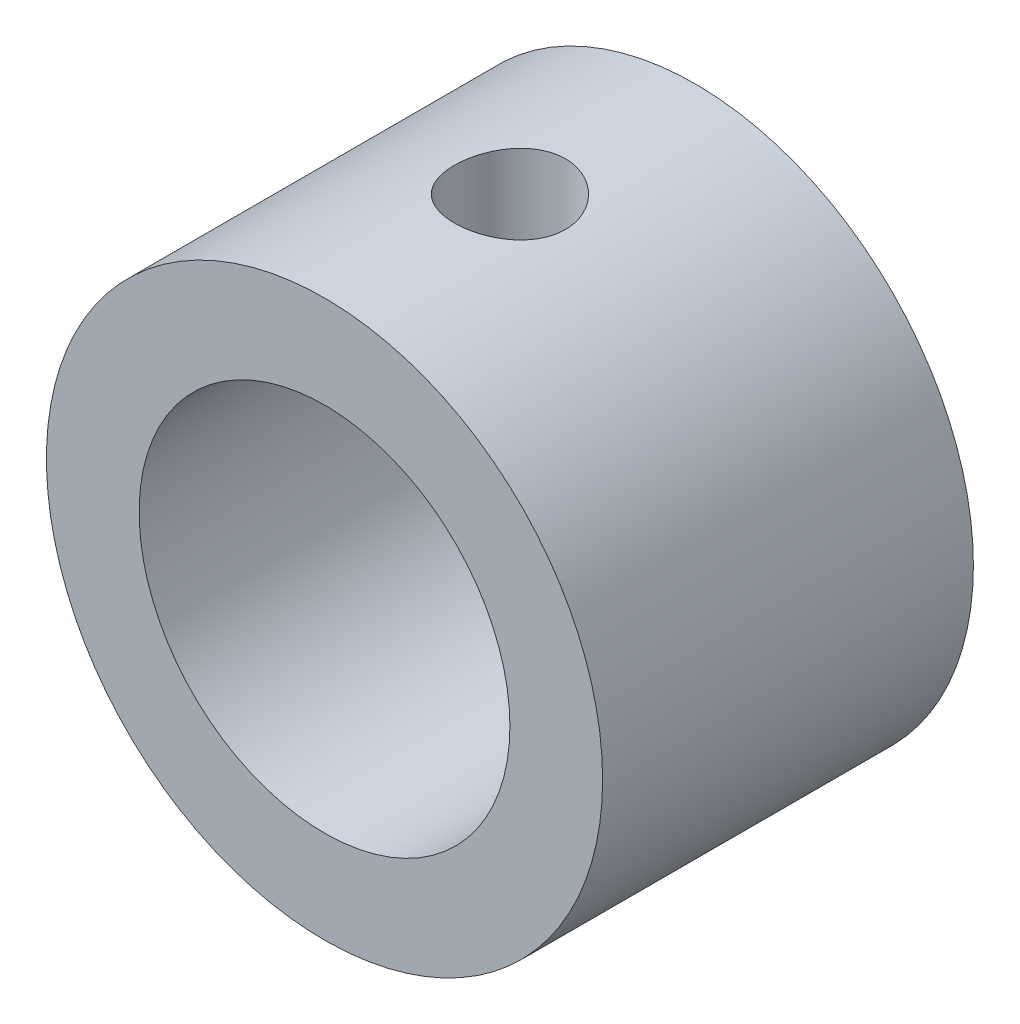
ISO-10303-21;
HEADER;
FILE_DESCRIPTION(('STEP AP214'),'2;1');
FILE_NAME('part.step','',(''),(''),'','','');
FILE_SCHEMA(('AUTOMOTIVE_DESIGN { 1 0 10303 214 1 1 1 1 }'));
ENDSEC;
DATA;
#1=APPLICATION_CONTEXT('core data for automotive mechanical design processes');
#2=APPLICATION_PROTOCOL_DEFINITION('international standard','automotive_design',2000,#1);
#3=PRODUCT_CONTEXT('',#1,'mechanical');
#4=PRODUCT('Part','Part','',(#3));
#5=PRODUCT_RELATED_PRODUCT_CATEGORY('part','',(#4));
#6=PRODUCT_DEFINITION_FORMATION('','',#4);
#7=PRODUCT_DEFINITION_CONTEXT('part definition',#1,'design');
#8=PRODUCT_DEFINITION('design','',#6,#7);
#9=PRODUCT_DEFINITION_SHAPE('','',#8);
#10=(LENGTH_UNIT() NAMED_UNIT(*) SI_UNIT(.MILLI.,.METRE.));
#11=(NAMED_UNIT(*) PLANE_ANGLE_UNIT() SI_UNIT($,.RADIAN.));
#12=(NAMED_UNIT(*) SI_UNIT($,.STERADIAN.) SOLID_ANGLE_UNIT());
#13=UNCERTAINTY_MEASURE_WITH_UNIT(LENGTH_MEASURE(1.E-05),#10,'distance_accuracy_value','');
#14=(GEOMETRIC_REPRESENTATION_CONTEXT(3) GLOBAL_UNCERTAINTY_ASSIGNED_CONTEXT((#13)) GLOBAL_UNIT_ASSIGNED_CONTEXT((#10,
#11,#12)) REPRESENTATION_CONTEXT('',''));
#15=CARTESIAN_POINT('',(0.,0.,0.));
#16=DIRECTION('',(0.,0.,1.));
#17=DIRECTION('',(1.,0.,0.));
#18=AXIS2_PLACEMENT_3D('',#15,#16,#17);
#19=CARTESIAN_POINT('',(0.,0.,5.));
#20=DIRECTION('',(0.,0.,-1.));
#21=DIRECTION('',(-1.,0.,0.));
#22=AXIS2_PLACEMENT_3D('',#19,#20,#21);
#23=CYLINDRICAL_SURFACE('',#22,7.5);
#24=CARTESIAN_POINT('',(0.,0.,5.));
#25=DIRECTION('',(0.,0.,1.));
#26=DIRECTION('',(1.,0.,0.));
#27=AXIS2_PLACEMENT_3D('',#24,#25,#26);
#28=CIRCLE('',#27,7.5);
#29=CARTESIAN_POINT('',(7.5,0.,5.));
#30=VERTEX_POINT('',#29);
#31=EDGE_CURVE('E10',#30,#30,#28,.T.);
#32=ORIENTED_EDGE('',*,*,#31,.F.);
#33=EDGE_LOOP('',(#32));
#34=FACE_BOUND('',#33,.T.);
#35=CARTESIAN_POINT('',(0.,0.,-5.));
#36=DIRECTION('',(0.,0.,1.));
#37=DIRECTION('',(1.,0.,0.));
#38=AXIS2_PLACEMENT_3D('',#35,#36,#37);
#39=CIRCLE('',#38,7.5);
#40=CARTESIAN_POINT('',(7.5,0.,-5.));
#41=VERTEX_POINT('',#40);
#42=EDGE_CURVE('E45',#41,#41,#39,.T.);
#43=ORIENTED_EDGE('',*,*,#42,.T.);
#44=EDGE_LOOP('',(#43));
#45=FACE_BOUND('',#44,.T.);
#46=CARTESIAN_POINT('',(0.,7.5,-1.5));
#47=CARTESIAN_POINT('',(-0.0833653601889498,7.49999846371307,-1.49999693325248));
#48=CARTESIAN_POINT('',(-0.166769490302284,7.49859577767346,-1.49302673554853));
#49=CARTESIAN_POINT('',(-0.331220261533529,7.49313548434847,-1.46535224982713));
#50=CARTESIAN_POINT('',(-0.412264976312034,7.48907576790279,-1.44463705079774));
#51=CARTESIAN_POINT('',(-0.569595457894969,7.4787547391743,-1.39013808956882));
#52=CARTESIAN_POINT('',(-0.645885701899701,7.47249553615077,-1.35636684473297));
#53=CARTESIAN_POINT('',(-0.791711983296338,7.45845597052971,-1.27675162873306));
#54=CARTESIAN_POINT('',(-0.861248422613718,7.4506756985356,-1.23090837658919));
#55=CARTESIAN_POINT('',(-0.992540215972297,7.43433247994955,-1.12779225856285));
#56=CARTESIAN_POINT('',(-1.05419092673779,7.42576118256521,-1.0703874669132));
#57=CARTESIAN_POINT('',(-1.16705513491204,7.40886270678882,-0.946061375412447));
#58=CARTESIAN_POINT('',(-1.21826781715564,7.40053554750636,-0.879139332997323));
#59=CARTESIAN_POINT('',(-1.30924763002143,7.38498662718923,-0.736925710482187));
#60=CARTESIAN_POINT('',(-1.3489064082988,7.37777561047419,-0.661563534305461));
#61=CARTESIAN_POINT('',(-1.41495849987046,7.36539402087627,-0.505077271493881));
#62=CARTESIAN_POINT('',(-1.44135312365586,7.36022324642942,-0.423953754980482));
#63=CARTESIAN_POINT('',(-1.47978794982724,7.35259207878307,-0.259373454138124));
#64=CARTESIAN_POINT('',(-1.49201174693817,7.35009705160781,-0.175961183786661));
#65=CARTESIAN_POINT('',(-1.50232819158918,7.34799562590941,-0.00823526795348636));
#66=CARTESIAN_POINT('',(-1.50042228407025,7.34838893201761,0.0760782844802178));
#67=CARTESIAN_POINT('',(-1.48268185965273,7.35198826722277,0.241870182031505));
#68=CARTESIAN_POINT('',(-1.46705781036586,7.35515179288145,0.323372108440971));
#69=CARTESIAN_POINT('',(-1.42265682693458,7.36386819240002,0.482574114994503));
#70=CARTESIAN_POINT('',(-1.39387926465102,7.36942118036668,0.560274013378512));
#71=CARTESIAN_POINT('',(-1.32378717551208,7.38233427750612,0.710272892555398));
#72=CARTESIAN_POINT('',(-1.28238922684817,7.38970634720557,0.782531819353757));
#73=CARTESIAN_POINT('',(-1.18829036185902,7.40541928159593,0.919156274959221));
#74=CARTESIAN_POINT('',(-1.13558814653524,7.41376025757549,0.983520895276736));
#75=CARTESIAN_POINT('',(-1.01924990184088,7.43065531862193,1.1037441036854));
#76=CARTESIAN_POINT('',(-0.955434241818668,7.43921053816357,1.1594288517887));
#77=CARTESIAN_POINT('',(-0.819277536093015,7.45543273071613,1.25933076945184));
#78=CARTESIAN_POINT('',(-0.746936381069084,7.4630996923346,1.30354779194037));
#79=CARTESIAN_POINT('',(-0.595589080318381,7.47670035241331,1.37929126383896));
#80=CARTESIAN_POINT('',(-0.51657272937795,7.48263133272408,1.41079784046681));
#81=CARTESIAN_POINT('',(-0.354223464672997,7.49207113481787,1.46004071105785));
#82=CARTESIAN_POINT('',(-0.270891075108675,7.49558025000797,1.47777867311044));
#83=CARTESIAN_POINT('',(-0.103769108440726,7.49974007800302,1.49873468069142));
#84=CARTESIAN_POINT('',(-0.0200104924883644,7.50043761978705,1.5021906293104));
#85=CARTESIAN_POINT('',(0.146887401289071,7.49902577895154,1.49512521158673));
#86=CARTESIAN_POINT('',(0.23002671366569,7.49691655412169,1.48460463097111));
#87=CARTESIAN_POINT('',(0.392558489919811,7.49015748012026,1.45008243968407));
#88=CARTESIAN_POINT('',(0.471977922509855,7.4855306460631,1.42620289725315));
#89=CARTESIAN_POINT('',(0.625685441249501,7.47425328091549,1.36577402601629));
#90=CARTESIAN_POINT('',(0.699973142456309,7.4676025982134,1.32922374798476));
#91=CARTESIAN_POINT('',(0.842311760529326,7.45289867299942,1.24397626402303));
#92=CARTESIAN_POINT('',(0.910275190128282,7.44482925655578,1.19513582844158));
#93=CARTESIAN_POINT('',(1.03712702867881,7.42822102244824,1.08688621318908));
#94=CARTESIAN_POINT('',(1.09601446339614,7.41968215452582,1.0274759004002));
#95=CARTESIAN_POINT('',(1.20396088616126,7.40293955335447,0.898689972163314));
#96=CARTESIAN_POINT('',(1.25285655367298,7.39474290349956,0.829176383667994));
#97=CARTESIAN_POINT('',(1.33827813007681,7.37976287694291,0.682782957964981));
#98=CARTESIAN_POINT('',(1.37480453388435,7.37297944370014,0.605903415639671));
#99=CARTESIAN_POINT('',(1.43422776237294,7.36165110876574,0.447347630775677));
#100=CARTESIAN_POINT('',(1.45719524968658,7.3570946230828,0.365698738184521));
#101=CARTESIAN_POINT('',(1.48906297744079,7.35071155188038,0.199599819763642));
#102=CARTESIAN_POINT('',(1.49796505233767,7.34888461036667,0.115150160685979));
#103=CARTESIAN_POINT('',(1.5013813663012,7.34818724447069,-0.0525132968164782));
#104=CARTESIAN_POINT('',(1.49615368210634,7.34926378783951,-0.135721723390514));
#105=CARTESIAN_POINT('',(1.47202845615009,7.35413360226921,-0.30004747485754));
#106=CARTESIAN_POINT('',(1.45313102419395,7.35792685150754,-0.381164816542207));
#107=CARTESIAN_POINT('',(1.40231785274843,7.36777896328738,-0.538841566860818));
#108=CARTESIAN_POINT('',(1.37043376007602,7.37383231528246,-0.615411540753623));
#109=CARTESIAN_POINT('',(1.29458196690241,7.38752572461255,-0.762155581101662));
#110=CARTESIAN_POINT('',(1.25061325316232,7.39516591498341,-0.832329110587706));
#111=CARTESIAN_POINT('',(1.15095887217962,7.41133440784838,-0.965573358225471));
#112=CARTESIAN_POINT('',(1.09508683085277,7.41987559364549,-1.02850314790139));
#113=CARTESIAN_POINT('',(0.973596553519711,7.43679122807932,-1.14417930829376));
#114=CARTESIAN_POINT('',(0.907976080730003,7.44516563794777,-1.19692333547591));
#115=CARTESIAN_POINT('',(0.76802644363237,7.46090748581957,-1.29125196591967));
#116=CARTESIAN_POINT('',(0.693613326644752,7.46826346828869,-1.33271400492004));
#117=CARTESIAN_POINT('',(0.538749541411099,7.481026876275,-1.40247918389489));
#118=CARTESIAN_POINT('',(0.458304391294689,7.48643605707924,-1.43079418429874));
#119=CARTESIAN_POINT('',(0.314732233385669,7.49364558893056,-1.46797792206707));
#120=CARTESIAN_POINT('',(0.252422496020677,7.49601454737677,-1.47996479056164));
#121=CARTESIAN_POINT('',(0.1267492878151,7.49919231209839,-1.49597686853755));
#122=CARTESIAN_POINT('',(0.0633858506229286,7.50000116809732,-1.50000233176465));
#123=CARTESIAN_POINT('',(0.,7.5,-1.5));
#124=B_SPLINE_CURVE_WITH_KNOTS('',3,(#46,#47,#48,#49,#50,#51,#52,#53,#54,#55,#56,#57,#58,#59,
#60,#61,#62,#63,#64,#65,#66,#67,#68,#69,#70,#71,#72,#73,#74,#75,#76,#77,#78,#79,#80,#81,#82,#83,
#84,#85,#86,#87,#88,#89,#90,#91,#92,#93,#94,#95,#96,#97,#98,#99,#100,#101,#102,#103,#104,#105,
#106,#107,#108,#109,#110,#111,#112,#113,#114,#115,#116,#117,#118,#119,#120,#121,#122,#123),
.UNSPECIFIED.,.T.,.F.,(4,2,2,2,2,2,2,2,2,2,2,2,2,2,2,2,2,2,2,2,2,2,2,2,2,2,2,2,2,2,2,2,2,2,2,2,
2,2,4),(0.,0.249864195991888,0.499926976036985,0.749750602875513,0.999559353346295,
1.25239900516828,1.50525839512105,1.76041792508884,2.01555224047796,2.26734277655381,
2.51910756421838,2.76707590509417,3.01505608880594,3.26471235305389,3.51439732124506,
3.76857378737026,4.0227535130973,4.27732912281036,4.53187388547054,4.78216103514398,
5.03243411486801,5.28045680926085,5.52849808824034,5.77957599050038,6.03068082518895,
6.28560942868839,6.540527830852,6.79410571549085,7.04765052495622,7.29659583851552,
7.54553915238913,7.79387941879665,8.042240513728,8.29482114358715,8.54745981799396,
8.80274245013456,9.05779433276278,9.24778162934841,9.43776287056494),.UNSPECIFIED.);
#125=CARTESIAN_POINT('',(0.,7.5,-1.5));
#126=VERTEX_POINT('',#125);
#127=EDGE_CURVE('E55',#126,#126,#124,.T.);
#128=ORIENTED_EDGE('',*,*,#127,.F.);
#129=EDGE_LOOP('',(#128));
#130=FACE_BOUND('',#129,.T.);
#131=ADVANCED_FACE('F32',(#34,#45,#130),#23,.T.);
#132=CARTESIAN_POINT('',(0.,0.,5.));
#133=DIRECTION('',(0.,0.,-1.));
#134=DIRECTION('',(-1.,0.,0.));
#135=AXIS2_PLACEMENT_3D('',#132,#133,#134);
#136=CYLINDRICAL_SURFACE('',#135,5.);
#137=CARTESIAN_POINT('',(0.,0.,-5.));
#138=DIRECTION('',(0.,0.,1.));
#139=DIRECTION('',(1.,0.,0.));
#140=AXIS2_PLACEMENT_3D('',#137,#138,#139);
#141=CIRCLE('',#140,5.);
#142=CARTESIAN_POINT('',(5.,0.,-5.));
#143=VERTEX_POINT('',#142);
#144=EDGE_CURVE('E52',#143,#143,#141,.T.);
#145=ORIENTED_EDGE('',*,*,#144,.F.);
#146=EDGE_LOOP('',(#145));
#147=FACE_BOUND('',#146,.T.);
#148=CARTESIAN_POINT('',(0.,0.,5.));
#149=DIRECTION('',(0.,0.,1.));
#150=DIRECTION('',(1.,0.,0.));
#151=AXIS2_PLACEMENT_3D('',#148,#149,#150);
#152=CIRCLE('',#151,5.);
#153=CARTESIAN_POINT('',(5.,0.,5.));
#154=VERTEX_POINT('',#153);
#155=EDGE_CURVE('E50',#154,#154,#152,.T.);
#156=ORIENTED_EDGE('',*,*,#155,.T.);
#157=EDGE_LOOP('',(#156));
#158=FACE_BOUND('',#157,.T.);
#159=CARTESIAN_POINT('',(0.,5.,-1.5));
#160=CARTESIAN_POINT('',(-0.0822886127533,4.9999992925055,-1.49999900251511));
#161=CARTESIAN_POINT('',(-0.164587318351529,4.99794915693954,-1.49320613637603));
#162=CARTESIAN_POINT('',(-0.326788125304881,4.98997105593691,-1.4662786457779));
#163=CARTESIAN_POINT('',(-0.40668950441142,4.98404193389692,-1.44614004197666));
#164=CARTESIAN_POINT('',(-0.561732707754527,4.96895552501836,-1.39325398308974));
#165=CARTESIAN_POINT('',(-0.636881364395373,4.95980300250425,-1.36052513038106));
#166=CARTESIAN_POINT('',(-0.780624181053131,4.93922109237645,-1.28346390694416));
#167=CARTESIAN_POINT('',(-0.849217467469669,4.92779140192067,-1.23912999260458));
#168=CARTESIAN_POINT('',(-0.979871797183745,4.90350737192774,-1.13877599252733));
#169=CARTESIAN_POINT('',(-1.04171807124434,4.89062383657036,-1.08248337411409));
#170=CARTESIAN_POINT('',(-1.15524920923324,4.86505834210442,-0.960390770089816));
#171=CARTESIAN_POINT('',(-1.20693236327441,4.85237641724501,-0.89458918787504));
#172=CARTESIAN_POINT('',(-1.29980037723708,4.82834113993772,-0.753529246962388));
#173=CARTESIAN_POINT('',(-1.34072309022213,4.81702406663875,-0.678091539009262));
#174=CARTESIAN_POINT('',(-1.4092139477476,4.79743620394031,-0.521010745769707));
#175=CARTESIAN_POINT('',(-1.43678529919973,4.78916468313311,-0.439369156072025));
#176=CARTESIAN_POINT('',(-1.47701633682652,4.77690870838434,-0.27460973386954));
#177=CARTESIAN_POINT('',(-1.49007196234677,4.77281069324533,-0.191597256136057));
#178=CARTESIAN_POINT('',(-1.50213730614672,4.76902789749767,-0.0244668437832341));
#179=CARTESIAN_POINT('',(-1.50115042761078,4.76934204760571,0.0596508180590879));
#180=CARTESIAN_POINT('',(-1.48546977199812,4.77424744067778,0.223383908608484));
#181=CARTESIAN_POINT('',(-1.47127205262685,4.7786838859914,0.303052250362239));
#182=CARTESIAN_POINT('',(-1.43037420427056,4.79108356228624,0.458819786273461));
#183=CARTESIAN_POINT('',(-1.40367284141641,4.79904714132351,0.534918627374333));
#184=CARTESIAN_POINT('',(-1.33816026653682,4.81772733074973,0.68260034966074));
#185=CARTESIAN_POINT('',(-1.29918816934642,4.82848016115952,0.754107083955263));
#186=CARTESIAN_POINT('',(-1.21035222588683,4.85150987000065,0.889732022010193));
#187=CARTESIAN_POINT('',(-1.16048574002588,4.86378711746991,0.953848429413778));
#188=CARTESIAN_POINT('',(-1.04881290765546,4.88911011297937,1.07568619076202));
#189=CARTESIAN_POINT('',(-0.986594907466972,4.90216654310498,1.13302866402967));
#190=CARTESIAN_POINT('',(-0.853263259313967,4.92712244063259,1.23655398406425));
#191=CARTESIAN_POINT('',(-0.782149051860888,4.9390218351841,1.28273612841443));
#192=CARTESIAN_POINT('',(-0.632355038342803,4.9604316006947,1.36285992246473));
#193=CARTESIAN_POINT('',(-0.55362774974795,4.96992543668314,1.39671751624986));
#194=CARTESIAN_POINT('',(-0.391245415603519,4.98533521832222,1.45059959009963));
#195=CARTESIAN_POINT('',(-0.307591751589581,4.99125216186999,1.47062792853249));
#196=CARTESIAN_POINT('',(-0.140952242668331,4.99868364643538,1.49565217789939));
#197=CARTESIAN_POINT('',(-0.0580500976011865,5.0003485041779,1.50116158580161));
#198=CARTESIAN_POINT('',(0.107499605823384,4.9995292324176,1.49843084428792));
#199=CARTESIAN_POINT('',(0.190147196690781,4.99704565677756,1.49019253034856));
#200=CARTESIAN_POINT('',(0.350903605309697,4.98830696987163,1.4606153888885));
#201=CARTESIAN_POINT('',(0.42907277261417,4.98213829799417,1.43957661241913));
#202=CARTESIAN_POINT('',(0.580754638954522,4.96674347841533,1.3853567672218));
#203=CARTESIAN_POINT('',(0.654266777025584,4.95751696321085,1.35217423896214));
#204=CARTESIAN_POINT('',(0.796437189461053,4.93669654351325,1.27374683451887));
#205=CARTESIAN_POINT('',(0.86494382619967,4.92505280829675,1.22824065905203));
#206=CARTESIAN_POINT('',(0.993523307980147,4.90073468764318,1.12677524594719));
#207=CARTESIAN_POINT('',(1.05359403235593,4.8880600443108,1.07081338811233));
#208=CARTESIAN_POINT('',(1.16585744551027,4.86253171869138,0.947612691630654));
#209=CARTESIAN_POINT('',(1.21768481231504,4.84968825033268,0.880038124228263));
#210=CARTESIAN_POINT('',(1.30928995072154,4.82576515238463,0.736872060986467));
#211=CARTESIAN_POINT('',(1.34906803829472,4.81468547654651,0.661280775441785));
#212=CARTESIAN_POINT('',(1.41517347127168,4.79567189615055,0.504467508745311));
#213=CARTESIAN_POINT('',(1.4415634693705,4.78772337843827,0.423273813463408));
#214=CARTESIAN_POINT('',(1.48021730815114,4.77591594362794,0.257312031068522));
#215=CARTESIAN_POINT('',(1.49248598978779,4.772055625083,0.172545179212331));
#216=CARTESIAN_POINT('',(1.50221984485059,4.76899972496087,0.00563848162377218));
#217=CARTESIAN_POINT('',(1.5002805530849,4.76961647442754,-0.0764636510175859));
#218=CARTESIAN_POINT('',(1.48307505444813,4.77499401288294,-0.2391141033728));
#219=CARTESIAN_POINT('',(1.46780938124716,4.77975463592551,-0.319662485176353));
#220=CARTESIAN_POINT('',(1.42476888804136,4.79275763670386,-0.475945399142852));
#221=CARTESIAN_POINT('',(1.39715175507068,4.80095604545965,-0.551727287361693));
#222=CARTESIAN_POINT('',(1.33031507121129,4.81990278909136,-0.697642438817723));
#223=CARTESIAN_POINT('',(1.29109329962876,4.83065161194312,-0.767774617640757));
#224=CARTESIAN_POINT('',(1.20048763805072,4.85397676425833,-0.903163116527113));
#225=CARTESIAN_POINT('',(1.14871276092994,4.86660540163798,-0.968148761260412));
#226=CARTESIAN_POINT('',(1.03517434629782,4.89201320450026,-1.08870249830786));
#227=CARTESIAN_POINT('',(0.973408217134501,4.90479240823905,-1.14426813946776));
#228=CARTESIAN_POINT('',(0.839465762183248,4.92950936570649,-1.24602341229503));
#229=CARTESIAN_POINT('',(0.767037885790608,4.94141159765674,-1.29189144685549));
#230=CARTESIAN_POINT('',(0.615141373983529,4.96260680455813,-1.37073516990403));
#231=CARTESIAN_POINT('',(0.535676052998955,4.97190099931067,-1.40371688827451));
#232=CARTESIAN_POINT('',(0.380757712655281,4.98602174969301,-1.45289527565275));
#233=CARTESIAN_POINT('',(0.305786961954234,4.99122027381068,-1.47051167288325));
#234=CARTESIAN_POINT('',(0.153880195230779,4.99820944494492,-1.49406352524158));
#235=CARTESIAN_POINT('',(0.0769445098581396,5.0000006615474,-1.50000093270482));
#236=CARTESIAN_POINT('',(0.,5.,-1.5));
#237=B_SPLINE_CURVE_WITH_KNOTS('',3,(#159,#160,#161,#162,#163,#164,#165,#166,#167,#168,#169,
#170,#171,#172,#173,#174,#175,#176,#177,#178,#179,#180,#181,#182,#183,#184,#185,#186,#187,#188,
#189,#190,#191,#192,#193,#194,#195,#196,#197,#198,#199,#200,#201,#202,#203,#204,#205,#206,#207,
#208,#209,#210,#211,#212,#213,#214,#215,#216,#217,#218,#219,#220,#221,#222,#223,#224,#225,#226,
#227,#228,#229,#230,#231,#232,#233,#234,#235,#236),.UNSPECIFIED.,.T.,.F.,(4,2,2,2,2,2,2,2,2,2,2,
2,2,2,2,2,2,2,2,2,2,2,2,2,2,2,2,2,2,2,2,2,2,2,2,2,2,2,4),(0.,0.246583203612611,0.493239964846,
0.739533676300874,0.985860164412702,1.23855602948191,1.49129437288633,1.74971481004109,
2.00807314543224,2.25919689356599,2.51025978319089,2.75226016697676,2.99428443658001,
3.23962426447119,3.48502360158555,3.74067104048167,3.99633456531071,4.25371046881689,
4.51101453528808,4.75908809438545,5.00712853550327,5.24956746682327,5.49203554593729,
5.74011305702908,5.98825282000191,6.24540400322818,6.5025484425268,6.75847814951252,
7.01432009460283,7.25950155466943,7.504673196616,7.74680040402721,7.98897397553107,
8.23996925679931,8.49102974897502,8.74942996156671,9.00770911595235,9.23831691930459,
9.46888616948874),.UNSPECIFIED.);
#238=CARTESIAN_POINT('',(0.,5.,-1.5));
#239=VERTEX_POINT('',#238);
#240=EDGE_CURVE('E36',#239,#239,#237,.T.);
#241=ORIENTED_EDGE('',*,*,#240,.T.);
#242=EDGE_LOOP('',(#241));
#243=FACE_BOUND('',#242,.T.);
#244=ADVANCED_FACE('F67',(#147,#158,#243),#136,.F.);
#245=CARTESIAN_POINT('',(0.,0.,5.));
#246=DIRECTION('',(0.,0.,1.));
#247=DIRECTION('',(1.,0.,0.));
#248=AXIS2_PLACEMENT_3D('',#245,#246,#247);
#249=PLANE('',#248);
#250=ORIENTED_EDGE('',*,*,#31,.T.);
#251=EDGE_LOOP('',(#250));
#252=FACE_BOUND('',#251,.T.);
#253=ORIENTED_EDGE('',*,*,#155,.F.);
#254=EDGE_LOOP('',(#253));
#255=FACE_BOUND('',#254,.T.);
#256=ADVANCED_FACE('F72',(#252,#255),#249,.T.);
#257=CARTESIAN_POINT('',(0.,0.,-5.));
#258=DIRECTION('',(0.,0.,1.));
#259=DIRECTION('',(1.,0.,0.));
#260=AXIS2_PLACEMENT_3D('',#257,#258,#259);
#261=PLANE('',#260);
#262=ORIENTED_EDGE('',*,*,#42,.F.);
#263=EDGE_LOOP('',(#262));
#264=FACE_BOUND('',#263,.T.);
#265=ORIENTED_EDGE('',*,*,#144,.T.);
#266=EDGE_LOOP('',(#265));
#267=FACE_BOUND('',#266,.T.);
#268=ADVANCED_FACE('F65',(#264,#267),#261,.F.);
#269=CARTESIAN_POINT('',(0.,9.,0.));
#270=DIRECTION('',(0.,-1.,0.));
#271=DIRECTION('',(0.,0.,-1.));
#272=AXIS2_PLACEMENT_3D('',#269,#270,#271);
#273=CYLINDRICAL_SURFACE('',#272,1.5);
#274=ORIENTED_EDGE('',*,*,#240,.F.);
#275=EDGE_LOOP('',(#274));
#276=FACE_BOUND('',#275,.T.);
#277=ORIENTED_EDGE('',*,*,#127,.T.);
#278=EDGE_LOOP('',(#277));
#279=FACE_BOUND('',#278,.T.);
#280=ADVANCED_FACE('F62',(#276,#279),#273,.F.);
#281=CLOSED_SHELL('',(#131,#244,#256,#268,#280));
#282=MANIFOLD_SOLID_BREP('B2',#281);
#283=ADVANCED_BREP_SHAPE_REPRESENTATION('',(#18,#282),#14);
#284=SHAPE_DEFINITION_REPRESENTATION(#9,#283);
ENDSEC;
END-ISO-10303-21;
